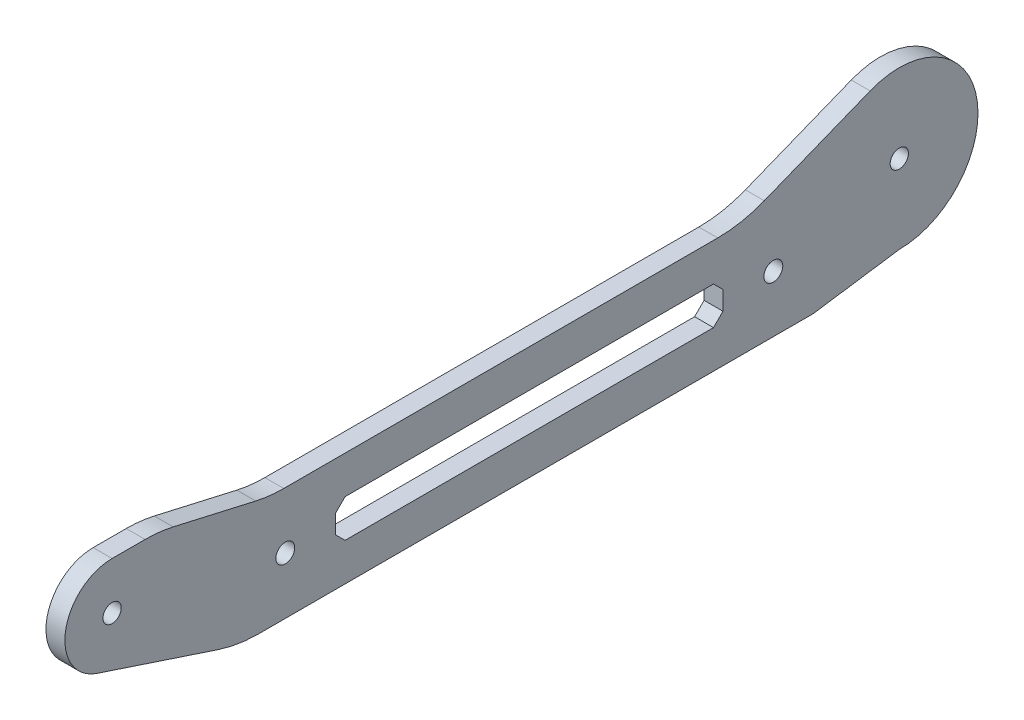
ISO-10303-21;
HEADER;
FILE_DESCRIPTION(('STEP AP214'),'2;1');
FILE_NAME('part.step','',(''),(''),'','','');
FILE_SCHEMA(('AUTOMOTIVE_DESIGN { 1 0 10303 214 1 1 1 1 }'));
ENDSEC;
DATA;
#1=APPLICATION_CONTEXT('core data for automotive mechanical design processes');
#2=APPLICATION_PROTOCOL_DEFINITION('international standard','automotive_design',2000,#1);
#3=PRODUCT_CONTEXT('',#1,'mechanical');
#4=PRODUCT('Part','Part','',(#3));
#5=PRODUCT_RELATED_PRODUCT_CATEGORY('part','',(#4));
#6=PRODUCT_DEFINITION_FORMATION('','',#4);
#7=PRODUCT_DEFINITION_CONTEXT('part definition',#1,'design');
#8=PRODUCT_DEFINITION('design','',#6,#7);
#9=PRODUCT_DEFINITION_SHAPE('','',#8);
#10=(LENGTH_UNIT() NAMED_UNIT(*) SI_UNIT(.MILLI.,.METRE.));
#11=(NAMED_UNIT(*) PLANE_ANGLE_UNIT() SI_UNIT($,.RADIAN.));
#12=(NAMED_UNIT(*) SI_UNIT($,.STERADIAN.) SOLID_ANGLE_UNIT());
#13=UNCERTAINTY_MEASURE_WITH_UNIT(LENGTH_MEASURE(1.E-05),#10,'distance_accuracy_value','');
#14=(GEOMETRIC_REPRESENTATION_CONTEXT(3) GLOBAL_UNCERTAINTY_ASSIGNED_CONTEXT((#13)) GLOBAL_UNIT_ASSIGNED_CONTEXT((#10,
#11,#12)) REPRESENTATION_CONTEXT('',''));
#15=CARTESIAN_POINT('',(0.,0.,0.));
#16=DIRECTION('',(0.,0.,1.));
#17=DIRECTION('',(1.,0.,0.));
#18=AXIS2_PLACEMENT_3D('',#15,#16,#17);
#19=CARTESIAN_POINT('',(1.5,10.5,10.5));
#20=DIRECTION('',(0.,0.707106781186548,0.707106781186547));
#21=DIRECTION('',(0.,-0.707106781186547,0.707106781186548));
#22=AXIS2_PLACEMENT_3D('',#19,#20,#21);
#23=PLANE('',#22);
#24=DIRECTION('',(0.,0.707106781186547,-0.707106781186548));
#25=VECTOR('',#24,1.);
#26=CARTESIAN_POINT('',(-1.5,10.5,10.5));
#27=LINE('',#26,#25);
#28=CARTESIAN_POINT('',(-1.5,-8.50000000000001,29.5));
#29=VERTEX_POINT('',#28);
#30=CARTESIAN_POINT('',(-1.5,-7.00000000000001,28.));
#31=VERTEX_POINT('',#30);
#32=EDGE_CURVE('E335',#29,#31,#27,.T.);
#33=ORIENTED_EDGE('',*,*,#32,.F.);
#34=DIRECTION('',(-1.,0.,0.));
#35=VECTOR('',#34,1.);
#36=CARTESIAN_POINT('',(1.5,-8.50000000000001,29.5));
#37=LINE('',#36,#35);
#38=CARTESIAN_POINT('',(1.5,-8.50000000000001,29.5));
#39=VERTEX_POINT('',#38);
#40=EDGE_CURVE('E218',#39,#29,#37,.T.);
#41=ORIENTED_EDGE('',*,*,#40,.F.);
#42=DIRECTION('',(0.,0.707106781186547,-0.707106781186548));
#43=VECTOR('',#42,1.);
#44=CARTESIAN_POINT('',(1.5,10.5,10.5));
#45=LINE('',#44,#43);
#46=CARTESIAN_POINT('',(1.5,-7.00000000000001,28.));
#47=VERTEX_POINT('',#46);
#48=EDGE_CURVE('E283',#39,#47,#45,.T.);
#49=ORIENTED_EDGE('',*,*,#48,.T.);
#50=DIRECTION('',(-1.,0.,0.));
#51=VECTOR('',#50,1.);
#52=CARTESIAN_POINT('',(1.5,-7.00000000000001,28.));
#53=LINE('',#52,#51);
#54=EDGE_CURVE('E205',#47,#31,#53,.T.);
#55=ORIENTED_EDGE('',*,*,#54,.T.);
#56=EDGE_LOOP('',(#33,#41,#49,#55));
#57=FACE_BOUND('',#56,.T.);
#58=ADVANCED_FACE('F35',(#57),#23,.T.);
#59=CARTESIAN_POINT('',(1.5,-8.50000000000001,0.));
#60=DIRECTION('',(0.,1.,0.));
#61=DIRECTION('',(0.,0.,1.));
#62=AXIS2_PLACEMENT_3D('',#59,#60,#61);
#63=PLANE('',#62);
#64=DIRECTION('',(0.,0.,-1.));
#65=VECTOR('',#64,1.);
#66=CARTESIAN_POINT('',(-1.5,-8.50000000000001,0.));
#67=LINE('',#66,#65);
#68=CARTESIAN_POINT('',(-1.5,-8.50000000000001,88.));
#69=VERTEX_POINT('',#68);
#70=EDGE_CURVE('E338',#69,#29,#67,.T.);
#71=ORIENTED_EDGE('',*,*,#70,.F.);
#72=DIRECTION('',(-1.,0.,0.));
#73=VECTOR('',#72,1.);
#74=CARTESIAN_POINT('',(1.5,-8.50000000000001,88.));
#75=LINE('',#74,#73);
#76=CARTESIAN_POINT('',(1.5,-8.50000000000001,88.));
#77=VERTEX_POINT('',#76);
#78=EDGE_CURVE('E374',#77,#69,#75,.T.);
#79=ORIENTED_EDGE('',*,*,#78,.F.);
#80=DIRECTION('',(0.,0.,-1.));
#81=VECTOR('',#80,1.);
#82=CARTESIAN_POINT('',(1.5,-8.50000000000001,0.));
#83=LINE('',#82,#81);
#84=EDGE_CURVE('E286',#77,#39,#83,.T.);
#85=ORIENTED_EDGE('',*,*,#84,.T.);
#86=ORIENTED_EDGE('',*,*,#40,.T.);
#87=EDGE_LOOP('',(#71,#79,#85,#86));
#88=FACE_BOUND('',#87,.T.);
#89=ADVANCED_FACE('F427',(#88),#63,.T.);
#90=CARTESIAN_POINT('',(1.5,-48.25,48.25));
#91=DIRECTION('',(0.,0.707106781186548,-0.707106781186547));
#92=DIRECTION('',(0.,0.707106781186547,0.707106781186548));
#93=AXIS2_PLACEMENT_3D('',#90,#91,#92);
#94=PLANE('',#93);
#95=DIRECTION('',(0.,-0.707106781186547,-0.707106781186548));
#96=VECTOR('',#95,1.);
#97=CARTESIAN_POINT('',(-1.5,-48.25,48.25));
#98=LINE('',#97,#96);
#99=CARTESIAN_POINT('',(-1.5,-7.00000000000001,89.5));
#100=VERTEX_POINT('',#99);
#101=EDGE_CURVE('E341',#100,#69,#98,.T.);
#102=ORIENTED_EDGE('',*,*,#101,.F.);
#103=DIRECTION('',(-1.,0.,0.));
#104=VECTOR('',#103,1.);
#105=CARTESIAN_POINT('',(1.5,-7.00000000000001,89.5));
#106=LINE('',#105,#104);
#107=CARTESIAN_POINT('',(1.5,-7.00000000000001,89.5));
#108=VERTEX_POINT('',#107);
#109=EDGE_CURVE('E372',#108,#100,#106,.T.);
#110=ORIENTED_EDGE('',*,*,#109,.F.);
#111=DIRECTION('',(0.,-0.707106781186547,-0.707106781186548));
#112=VECTOR('',#111,1.);
#113=CARTESIAN_POINT('',(1.5,-48.25,48.25));
#114=LINE('',#113,#112);
#115=EDGE_CURVE('E289',#108,#77,#114,.T.);
#116=ORIENTED_EDGE('',*,*,#115,.T.);
#117=ORIENTED_EDGE('',*,*,#78,.T.);
#118=EDGE_LOOP('',(#102,#110,#116,#117));
#119=FACE_BOUND('',#118,.T.);
#120=ADVANCED_FACE('F433',(#119),#94,.T.);
#121=CARTESIAN_POINT('',(1.5,0.,89.5));
#122=DIRECTION('',(0.,0.,-1.));
#123=DIRECTION('',(-1.,0.,0.));
#124=AXIS2_PLACEMENT_3D('',#121,#122,#123);
#125=PLANE('',#124);
#126=DIRECTION('',(0.,-1.,0.));
#127=VECTOR('',#126,1.);
#128=CARTESIAN_POINT('',(-1.5,0.,89.5));
#129=LINE('',#128,#127);
#130=CARTESIAN_POINT('',(-1.5,-4.00000000000002,89.5));
#131=VERTEX_POINT('',#130);
#132=EDGE_CURVE('E344',#131,#100,#129,.T.);
#133=ORIENTED_EDGE('',*,*,#132,.F.);
#134=DIRECTION('',(-1.,0.,0.));
#135=VECTOR('',#134,1.);
#136=CARTESIAN_POINT('',(1.5,-4.00000000000002,89.5));
#137=LINE('',#136,#135);
#138=CARTESIAN_POINT('',(1.5,-4.00000000000002,89.5));
#139=VERTEX_POINT('',#138);
#140=EDGE_CURVE('E370',#139,#131,#137,.T.);
#141=ORIENTED_EDGE('',*,*,#140,.F.);
#142=DIRECTION('',(0.,-1.,0.));
#143=VECTOR('',#142,1.);
#144=CARTESIAN_POINT('',(1.5,0.,89.5));
#145=LINE('',#144,#143);
#146=EDGE_CURVE('E292',#139,#108,#145,.T.);
#147=ORIENTED_EDGE('',*,*,#146,.T.);
#148=ORIENTED_EDGE('',*,*,#109,.T.);
#149=EDGE_LOOP('',(#133,#141,#147,#148));
#150=FACE_BOUND('',#149,.T.);
#151=ADVANCED_FACE('F478',(#150),#125,.T.);
#152=CARTESIAN_POINT('',(1.5,42.75,42.75));
#153=DIRECTION('',(0.,0.707106781186548,0.707106781186547));
#154=DIRECTION('',(0.,-0.707106781186547,0.707106781186548));
#155=AXIS2_PLACEMENT_3D('',#152,#153,#154);
#156=PLANE('',#155);
#157=DIRECTION('',(0.,0.707106781186547,-0.707106781186548));
#158=VECTOR('',#157,1.);
#159=CARTESIAN_POINT('',(-1.5,42.75,42.75));
#160=LINE('',#159,#158);
#161=CARTESIAN_POINT('',(-1.5,-2.50000000000001,88.));
#162=VERTEX_POINT('',#161);
#163=EDGE_CURVE('E347',#131,#162,#160,.T.);
#164=ORIENTED_EDGE('',*,*,#163,.T.);
#165=DIRECTION('',(-1.,0.,0.));
#166=VECTOR('',#165,1.);
#167=CARTESIAN_POINT('',(1.5,-2.50000000000001,88.));
#168=LINE('',#167,#166);
#169=CARTESIAN_POINT('',(1.5,-2.50000000000001,88.));
#170=VERTEX_POINT('',#169);
#171=EDGE_CURVE('E367',#170,#162,#168,.T.);
#172=ORIENTED_EDGE('',*,*,#171,.F.);
#173=DIRECTION('',(0.,0.707106781186547,-0.707106781186548));
#174=VECTOR('',#173,1.);
#175=CARTESIAN_POINT('',(1.5,42.75,42.75));
#176=LINE('',#175,#174);
#177=EDGE_CURVE('E295',#139,#170,#176,.T.);
#178=ORIENTED_EDGE('',*,*,#177,.F.);
#179=ORIENTED_EDGE('',*,*,#140,.T.);
#180=EDGE_LOOP('',(#164,#172,#178,#179));
#181=FACE_BOUND('',#180,.T.);
#182=ADVANCED_FACE('F474',(#181),#156,.F.);
#183=CARTESIAN_POINT('',(1.5,-2.50000000000001,0.));
#184=DIRECTION('',(0.,1.,0.));
#185=DIRECTION('',(0.,0.,1.));
#186=AXIS2_PLACEMENT_3D('',#183,#184,#185);
#187=PLANE('',#186);
#188=DIRECTION('',(0.,0.,-1.));
#189=VECTOR('',#188,1.);
#190=CARTESIAN_POINT('',(-1.5,-2.50000000000001,0.));
#191=LINE('',#190,#189);
#192=CARTESIAN_POINT('',(-1.5,-2.50000000000001,29.5));
#193=VERTEX_POINT('',#192);
#194=EDGE_CURVE('E350',#162,#193,#191,.T.);
#195=ORIENTED_EDGE('',*,*,#194,.T.);
#196=DIRECTION('',(-1.,0.,0.));
#197=VECTOR('',#196,1.);
#198=CARTESIAN_POINT('',(1.5,-2.50000000000001,29.5));
#199=LINE('',#198,#197);
#200=CARTESIAN_POINT('',(1.5,-2.50000000000001,29.5));
#201=VERTEX_POINT('',#200);
#202=EDGE_CURVE('E364',#201,#193,#199,.T.);
#203=ORIENTED_EDGE('',*,*,#202,.F.);
#204=DIRECTION('',(0.,0.,-1.));
#205=VECTOR('',#204,1.);
#206=CARTESIAN_POINT('',(1.5,-2.50000000000001,0.));
#207=LINE('',#206,#205);
#208=EDGE_CURVE('E298',#170,#201,#207,.T.);
#209=ORIENTED_EDGE('',*,*,#208,.F.);
#210=ORIENTED_EDGE('',*,*,#171,.T.);
#211=EDGE_LOOP('',(#195,#203,#209,#210));
#212=FACE_BOUND('',#211,.T.);
#213=ADVANCED_FACE('F470',(#212),#187,.F.);
#214=CARTESIAN_POINT('',(1.5,-16.,16.));
#215=DIRECTION('',(0.,0.707106781186548,-0.707106781186547));
#216=DIRECTION('',(0.,0.707106781186547,0.707106781186548));
#217=AXIS2_PLACEMENT_3D('',#214,#215,#216);
#218=PLANE('',#217);
#219=DIRECTION('',(0.,-0.707106781186547,-0.707106781186548));
#220=VECTOR('',#219,1.);
#221=CARTESIAN_POINT('',(-1.5,-16.,16.));
#222=LINE('',#221,#220);
#223=CARTESIAN_POINT('',(-1.5,-4.00000000000001,28.));
#224=VERTEX_POINT('',#223);
#225=EDGE_CURVE('E353',#193,#224,#222,.T.);
#226=ORIENTED_EDGE('',*,*,#225,.T.);
#227=DIRECTION('',(-1.,0.,0.));
#228=VECTOR('',#227,1.);
#229=CARTESIAN_POINT('',(1.5,-4.00000000000001,28.));
#230=LINE('',#229,#228);
#231=CARTESIAN_POINT('',(1.5,-4.00000000000001,28.));
#232=VERTEX_POINT('',#231);
#233=EDGE_CURVE('E208',#232,#224,#230,.T.);
#234=ORIENTED_EDGE('',*,*,#233,.F.);
#235=DIRECTION('',(0.,-0.707106781186547,-0.707106781186548));
#236=VECTOR('',#235,1.);
#237=CARTESIAN_POINT('',(1.5,-16.,16.));
#238=LINE('',#237,#236);
#239=EDGE_CURVE('E301',#201,#232,#238,.T.);
#240=ORIENTED_EDGE('',*,*,#239,.F.);
#241=ORIENTED_EDGE('',*,*,#202,.T.);
#242=EDGE_LOOP('',(#226,#234,#240,#241));
#243=FACE_BOUND('',#242,.T.);
#244=ADVANCED_FACE('F467',(#243),#218,.F.);
#245=CARTESIAN_POINT('',(1.5,0.,0.));
#246=DIRECTION('',(-1.,0.,0.));
#247=DIRECTION('',(0.,0.,1.));
#248=AXIS2_PLACEMENT_3D('',#245,#246,#247);
#249=CYLINDRICAL_SURFACE('',#248,12.5);
#250=CARTESIAN_POINT('',(-1.5,0.,0.));
#251=DIRECTION('',(1.,0.,0.));
#252=DIRECTION('',(0.,0.,-1.));
#253=AXIS2_PLACEMENT_3D('',#250,#251,#252);
#254=CIRCLE('',#253,12.5);
#255=CARTESIAN_POINT('',(-1.5,-12.5,0.));
#256=VERTEX_POINT('',#255);
#257=CARTESIAN_POINT('',(-1.5,11.6132366611717,4.62414686743596));
#258=VERTEX_POINT('',#257);
#259=EDGE_CURVE('E204',#256,#258,#254,.T.);
#260=ORIENTED_EDGE('',*,*,#259,.T.);
#261=DIRECTION('',(-1.,0.,0.));
#262=VECTOR('',#261,1.);
#263=CARTESIAN_POINT('',(1.5,11.6132366611717,4.62414686743596));
#264=LINE('',#263,#262);
#265=CARTESIAN_POINT('',(1.5,11.6132366611717,4.62414686743596));
#266=VERTEX_POINT('',#265);
#267=EDGE_CURVE('E183',#266,#258,#264,.T.);
#268=ORIENTED_EDGE('',*,*,#267,.F.);
#269=CARTESIAN_POINT('',(1.5,0.,0.));
#270=DIRECTION('',(1.,0.,0.));
#271=DIRECTION('',(0.,0.,-1.));
#272=AXIS2_PLACEMENT_3D('',#269,#270,#271);
#273=CIRCLE('',#272,12.5);
#274=CARTESIAN_POINT('',(1.5,-12.5,0.));
#275=VERTEX_POINT('',#274);
#276=EDGE_CURVE('E189',#275,#266,#273,.T.);
#277=ORIENTED_EDGE('',*,*,#276,.F.);
#278=DIRECTION('',(-1.,0.,0.));
#279=VECTOR('',#278,1.);
#280=CARTESIAN_POINT('',(1.5,-12.5,0.));
#281=LINE('',#280,#279);
#282=EDGE_CURVE('E309',#275,#256,#281,.T.);
#283=ORIENTED_EDGE('',*,*,#282,.T.);
#284=EDGE_LOOP('',(#260,#268,#277,#283));
#285=FACE_BOUND('',#284,.T.);
#286=ADVANCED_FACE('F202',(#285),#249,.T.);
#287=CARTESIAN_POINT('',(1.5,11.6132366611717,4.62414686743597));
#288=DIRECTION('',(0.,0.929058932893735,0.369931749394877));
#289=DIRECTION('',(0.,-0.369931749394877,0.929058932893735));
#290=AXIS2_PLACEMENT_3D('',#287,#288,#289);
#291=PLANE('',#290);
#292=DIRECTION('',(0.,0.369931749394877,-0.929058932893735));
#293=VECTOR('',#292,1.);
#294=CARTESIAN_POINT('',(-1.5,11.6132366611717,4.62414686743597));
#295=LINE('',#294,#293);
#296=CARTESIAN_POINT('',(-1.5,4.9188213421253,21.4367247627758));
#297=VERTEX_POINT('',#296);
#298=EDGE_CURVE('E248',#297,#258,#295,.T.);
#299=ORIENTED_EDGE('',*,*,#298,.F.);
#300=DIRECTION('',(-1.,0.,0.));
#301=VECTOR('',#300,1.);
#302=CARTESIAN_POINT('',(1.5,4.9188213421253,21.4367247627758));
#303=LINE('',#302,#301);
#304=CARTESIAN_POINT('',(1.5,4.9188213421253,21.4367247627758));
#305=VERTEX_POINT('',#304);
#306=EDGE_CURVE('E186',#297,#305,#303,.F.);
#307=ORIENTED_EDGE('',*,*,#306,.T.);
#308=DIRECTION('',(0.,0.369931749394877,-0.929058932893735));
#309=VECTOR('',#308,1.);
#310=CARTESIAN_POINT('',(1.5,11.6132366611717,4.62414686743597));
#311=LINE('',#310,#309);
#312=EDGE_CURVE('E178',#305,#266,#311,.T.);
#313=ORIENTED_EDGE('',*,*,#312,.T.);
#314=ORIENTED_EDGE('',*,*,#267,.T.);
#315=EDGE_LOOP('',(#299,#307,#313,#314));
#316=FACE_BOUND('',#315,.T.);
#317=ADVANCED_FACE('F181',(#316),#291,.T.);
#318=CARTESIAN_POINT('',(1.5,3.5,0.));
#319=DIRECTION('',(0.,1.,0.));
#320=DIRECTION('',(0.,0.,1.));
#321=AXIS2_PLACEMENT_3D('',#318,#319,#320);
#322=PLANE('',#321);
#323=DIRECTION('',(0.,0.,-1.));
#324=VECTOR('',#323,1.);
#325=CARTESIAN_POINT('',(-1.5,3.5,0.));
#326=LINE('',#325,#324);
#327=CARTESIAN_POINT('',(-1.5,3.5,97.7433846449188));
#328=VERTEX_POINT('',#327);
#329=CARTESIAN_POINT('',(-1.5,3.5,28.8353597506734));
#330=VERTEX_POINT('',#329);
#331=EDGE_CURVE('E250',#328,#330,#326,.T.);
#332=ORIENTED_EDGE('',*,*,#331,.F.);
#333=DIRECTION('',(-1.,0.,0.));
#334=VECTOR('',#333,1.);
#335=CARTESIAN_POINT('',(1.5,3.5,97.7433846449188));
#336=LINE('',#335,#334);
#337=CARTESIAN_POINT('',(1.5,3.5,97.7433846449188));
#338=VERTEX_POINT('',#337);
#339=EDGE_CURVE('E233',#328,#338,#336,.F.);
#340=ORIENTED_EDGE('',*,*,#339,.T.);
#341=DIRECTION('',(0.,0.,-1.));
#342=VECTOR('',#341,1.);
#343=CARTESIAN_POINT('',(1.5,3.5,0.));
#344=LINE('',#343,#342);
#345=CARTESIAN_POINT('',(1.5,3.5,28.8353597506734));
#346=VERTEX_POINT('',#345);
#347=EDGE_CURVE('E188',#338,#346,#344,.T.);
#348=ORIENTED_EDGE('',*,*,#347,.T.);
#349=DIRECTION('',(-1.,0.,0.));
#350=VECTOR('',#349,1.);
#351=CARTESIAN_POINT('',(-1.5,3.5,28.8353597506734));
#352=LINE('',#351,#350);
#353=EDGE_CURVE('E230',#346,#330,#352,.T.);
#354=ORIENTED_EDGE('',*,*,#353,.T.);
#355=EDGE_LOOP('',(#332,#340,#348,#354));
#356=FACE_BOUND('',#355,.T.);
#357=ADVANCED_FACE('F259',(#356),#322,.T.);
#358=CARTESIAN_POINT('',(1.5,-18.3960434445307,4.20480993017844));
#359=DIRECTION('',(0.,0.974858506571867,-0.222824801502141));
#360=DIRECTION('',(0.,0.222824801502141,0.974858506571867));
#361=AXIS2_PLACEMENT_3D('',#358,#359,#360);
#362=PLANE('',#361);
#363=DIRECTION('',(0.,-0.222824801502141,-0.974858506571867));
#364=VECTOR('',#363,1.);
#365=CARTESIAN_POINT('',(-1.5,-18.3960434445307,4.20480993017844));
#366=LINE('',#365,#364);
#367=CARTESIAN_POINT('',(-1.5,6.99717013143736,115.300119325038));
#368=VERTEX_POINT('',#367);
#369=CARTESIAN_POINT('',(-1.5,4.00282986856266,102.199880674962));
#370=VERTEX_POINT('',#369);
#371=EDGE_CURVE('E315',#368,#370,#366,.T.);
#372=ORIENTED_EDGE('',*,*,#371,.F.);
#373=DIRECTION('',(-1.,0.,0.));
#374=VECTOR('',#373,1.);
#375=CARTESIAN_POINT('',(1.5,6.99717013143735,115.300119325038));
#376=LINE('',#375,#374);
#377=CARTESIAN_POINT('',(1.5,6.99717013143736,115.300119325038));
#378=VERTEX_POINT('',#377);
#379=EDGE_CURVE('E225',#368,#378,#376,.F.);
#380=ORIENTED_EDGE('',*,*,#379,.T.);
#381=DIRECTION('',(0.,-0.222824801502141,-0.974858506571867));
#382=VECTOR('',#381,1.);
#383=CARTESIAN_POINT('',(1.5,-18.3960434445307,4.20480993017844));
#384=LINE('',#383,#382);
#385=CARTESIAN_POINT('',(1.5,4.00282986856266,102.199880674962));
#386=VERTEX_POINT('',#385);
#387=EDGE_CURVE('E261',#378,#386,#384,.T.);
#388=ORIENTED_EDGE('',*,*,#387,.T.);
#389=DIRECTION('',(-1.,0.,0.));
#390=VECTOR('',#389,1.);
#391=CARTESIAN_POINT('',(-1.5,4.00282986856265,102.199880674962));
#392=LINE('',#391,#390);
#393=EDGE_CURVE('E222',#386,#370,#392,.T.);
#394=ORIENTED_EDGE('',*,*,#393,.T.);
#395=EDGE_LOOP('',(#372,#380,#388,#394));
#396=FACE_BOUND('',#395,.T.);
#397=ADVANCED_FACE('F398',(#396),#362,.T.);
#398=CARTESIAN_POINT('',(1.5,7.4999999999998,0.));
#399=DIRECTION('',(0.,1.,0.));
#400=DIRECTION('',(0.,0.,1.));
#401=AXIS2_PLACEMENT_3D('',#398,#399,#400);
#402=PLANE('',#401);
#403=DIRECTION('',(0.,0.,-1.));
#404=VECTOR('',#403,1.);
#405=CARTESIAN_POINT('',(1.5,7.4999999999998,0.));
#406=LINE('',#405,#404);
#407=CARTESIAN_POINT('',(1.5,7.50000000000001,125.));
#408=VERTEX_POINT('',#407);
#409=CARTESIAN_POINT('',(1.5,7.5,119.756615355081));
#410=VERTEX_POINT('',#409);
#411=EDGE_CURVE('E264',#408,#410,#406,.T.);
#412=ORIENTED_EDGE('',*,*,#411,.T.);
#413=DIRECTION('',(-1.,0.,0.));
#414=VECTOR('',#413,1.);
#415=CARTESIAN_POINT('',(1.5,7.5,119.756615355081));
#416=LINE('',#415,#414);
#417=CARTESIAN_POINT('',(-1.5,7.5,119.756615355081));
#418=VERTEX_POINT('',#417);
#419=EDGE_CURVE('E214',#410,#418,#416,.T.);
#420=ORIENTED_EDGE('',*,*,#419,.T.);
#421=DIRECTION('',(0.,0.,-1.));
#422=VECTOR('',#421,1.);
#423=CARTESIAN_POINT('',(-1.5,7.4999999999998,0.));
#424=LINE('',#423,#422);
#425=CARTESIAN_POINT('',(-1.5,7.50000000000001,125.));
#426=VERTEX_POINT('',#425);
#427=EDGE_CURVE('E318',#426,#418,#424,.T.);
#428=ORIENTED_EDGE('',*,*,#427,.F.);
#429=DIRECTION('',(-1.,0.,0.));
#430=VECTOR('',#429,1.);
#431=CARTESIAN_POINT('',(1.5,7.50000000000001,125.));
#432=LINE('',#431,#430);
#433=EDGE_CURVE('E206',#408,#426,#432,.T.);
#434=ORIENTED_EDGE('',*,*,#433,.F.);
#435=EDGE_LOOP('',(#412,#420,#428,#434));
#436=FACE_BOUND('',#435,.T.);
#437=ADVANCED_FACE('F389',(#436),#402,.T.);
#438=CARTESIAN_POINT('',(1.5,0.,125.));
#439=DIRECTION('',(-1.,0.,0.));
#440=DIRECTION('',(0.,0.,1.));
#441=AXIS2_PLACEMENT_3D('',#438,#439,#440);
#442=CYLINDRICAL_SURFACE('',#441,7.50000000000001);
#443=CARTESIAN_POINT('',(-1.5,0.,125.));
#444=DIRECTION('',(1.,0.,0.));
#445=DIRECTION('',(0.,0.,-1.));
#446=AXIS2_PLACEMENT_3D('',#443,#444,#445);
#447=CIRCLE('',#446,7.50000000000001);
#448=CARTESIAN_POINT('',(-1.5,-7.12200850271521,127.350956164468));
#449=VERTEX_POINT('',#448);
#450=EDGE_CURVE('E320',#426,#449,#447,.T.);
#451=ORIENTED_EDGE('',*,*,#450,.T.);
#452=DIRECTION('',(-1.,0.,0.));
#453=VECTOR('',#452,1.);
#454=CARTESIAN_POINT('',(1.5,-7.12200850271521,127.350956164468));
#455=LINE('',#454,#453);
#456=CARTESIAN_POINT('',(1.5,-7.12200850271521,127.350956164468));
#457=VERTEX_POINT('',#456);
#458=EDGE_CURVE('E210',#457,#449,#455,.T.);
#459=ORIENTED_EDGE('',*,*,#458,.F.);
#460=CARTESIAN_POINT('',(1.5,0.,125.));
#461=DIRECTION('',(1.,0.,0.));
#462=DIRECTION('',(0.,0.,-1.));
#463=AXIS2_PLACEMENT_3D('',#460,#461,#462);
#464=CIRCLE('',#463,7.50000000000001);
#465=EDGE_CURVE('E269',#408,#457,#464,.T.);
#466=ORIENTED_EDGE('',*,*,#465,.F.);
#467=ORIENTED_EDGE('',*,*,#433,.T.);
#468=EDGE_LOOP('',(#451,#459,#466,#467));
#469=FACE_BOUND('',#468,.T.);
#470=ADVANCED_FACE('F386',(#469),#442,.T.);
#471=CARTESIAN_POINT('',(1.5,-44.3298524868384,14.6331670250296));
#472=DIRECTION('',(0.,-0.949601133695359,0.313460821929135));
#473=DIRECTION('',(0.,-0.313460821929135,-0.949601133695359));
#474=AXIS2_PLACEMENT_3D('',#471,#472,#473);
#475=PLANE('',#474);
#476=DIRECTION('',(0.,0.313460821929135,0.949601133695359));
#477=VECTOR('',#476,1.);
#478=CARTESIAN_POINT('',(-1.5,-44.3298524868384,14.6331670250296));
#479=LINE('',#478,#477);
#480=CARTESIAN_POINT('',(-1.5,-13.4920226739072,108.05357590051));
#481=VERTEX_POINT('',#480);
#482=EDGE_CURVE('E323',#481,#449,#479,.T.);
#483=ORIENTED_EDGE('',*,*,#482,.F.);
#484=DIRECTION('',(-1.,0.,0.));
#485=VECTOR('',#484,1.);
#486=CARTESIAN_POINT('',(1.5,-13.4920226739072,108.05357590051));
#487=LINE('',#486,#485);
#488=CARTESIAN_POINT('',(1.5,-13.4920226739072,108.05357590051));
#489=VERTEX_POINT('',#488);
#490=EDGE_CURVE('E58',#481,#489,#487,.F.);
#491=ORIENTED_EDGE('',*,*,#490,.T.);
#492=DIRECTION('',(0.,0.313460821929135,0.949601133695359));
#493=VECTOR('',#492,1.);
#494=CARTESIAN_POINT('',(1.5,-44.3298524868384,14.6331670250296));
#495=LINE('',#494,#493);
#496=EDGE_CURVE('E272',#489,#457,#495,.T.);
#497=ORIENTED_EDGE('',*,*,#496,.T.);
#498=ORIENTED_EDGE('',*,*,#458,.T.);
#499=EDGE_LOOP('',(#483,#491,#497,#498));
#500=FACE_BOUND('',#499,.T.);
#501=ADVANCED_FACE('F382',(#500),#475,.T.);
#502=CARTESIAN_POINT('',(1.5,-14.5,0.));
#503=DIRECTION('',(0.,1.,0.));
#504=DIRECTION('',(0.,0.,1.));
#505=AXIS2_PLACEMENT_3D('',#502,#503,#504);
#506=PLANE('',#505);
#507=DIRECTION('',(0.,0.,-1.));
#508=VECTOR('',#507,1.);
#509=CARTESIAN_POINT('',(1.5,-14.5,0.));
#510=LINE('',#509,#508);
#511=CARTESIAN_POINT('',(1.5,-14.5,101.784359461928));
#512=VERTEX_POINT('',#511);
#513=CARTESIAN_POINT('',(1.5,-14.5,13.675));
#514=VERTEX_POINT('',#513);
#515=EDGE_CURVE('E274',#512,#514,#510,.T.);
#516=ORIENTED_EDGE('',*,*,#515,.F.);
#517=DIRECTION('',(-1.,0.,0.));
#518=VECTOR('',#517,1.);
#519=CARTESIAN_POINT('',(-1.5,-14.5,101.784359461928));
#520=LINE('',#519,#518);
#521=CARTESIAN_POINT('',(-1.5,-14.5,101.784359461928));
#522=VERTEX_POINT('',#521);
#523=EDGE_CURVE('E236',#512,#522,#520,.T.);
#524=ORIENTED_EDGE('',*,*,#523,.T.);
#525=DIRECTION('',(0.,0.,-1.));
#526=VECTOR('',#525,1.);
#527=CARTESIAN_POINT('',(-1.5,-14.5,0.));
#528=LINE('',#527,#526);
#529=CARTESIAN_POINT('',(-1.5,-14.5,13.675));
#530=VERTEX_POINT('',#529);
#531=EDGE_CURVE('E325',#522,#530,#528,.T.);
#532=ORIENTED_EDGE('',*,*,#531,.T.);
#533=DIRECTION('',(-1.,0.,0.));
#534=VECTOR('',#533,1.);
#535=CARTESIAN_POINT('',(1.5,-14.5,13.675));
#536=LINE('',#535,#534);
#537=EDGE_CURVE('E378',#514,#530,#536,.T.);
#538=ORIENTED_EDGE('',*,*,#537,.F.);
#539=EDGE_LOOP('',(#516,#524,#532,#538));
#540=FACE_BOUND('',#539,.T.);
#541=ADVANCED_FACE('F406',(#540),#506,.F.);
#542=CARTESIAN_POINT('',(1.5,0.,28.));
#543=DIRECTION('',(0.,0.,-1.));
#544=DIRECTION('',(-1.,0.,0.));
#545=AXIS2_PLACEMENT_3D('',#542,#543,#544);
#546=PLANE('',#545);
#547=DIRECTION('',(0.,-1.,0.));
#548=VECTOR('',#547,1.);
#549=CARTESIAN_POINT('',(-1.5,0.,28.));
#550=LINE('',#549,#548);
#551=EDGE_CURVE('E356',#224,#31,#550,.T.);
#552=ORIENTED_EDGE('',*,*,#551,.T.);
#553=ORIENTED_EDGE('',*,*,#54,.F.);
#554=DIRECTION('',(0.,-1.,0.));
#555=VECTOR('',#554,1.);
#556=CARTESIAN_POINT('',(1.5,0.,28.));
#557=LINE('',#556,#555);
#558=EDGE_CURVE('E304',#232,#47,#557,.T.);
#559=ORIENTED_EDGE('',*,*,#558,.F.);
#560=ORIENTED_EDGE('',*,*,#233,.T.);
#561=EDGE_LOOP('',(#552,#553,#559,#560));
#562=FACE_BOUND('',#561,.T.);
#563=ADVANCED_FACE('F440',(#562),#546,.F.);
#564=CARTESIAN_POINT('',(1.5,-5.5,97.5));
#565=DIRECTION('',(-1.,0.,0.));
#566=DIRECTION('',(0.,0.,1.));
#567=AXIS2_PLACEMENT_3D('',#564,#565,#566);
#568=CYLINDRICAL_SURFACE('',#567,1.5);
#569=CARTESIAN_POINT('',(1.5,-5.5,97.5));
#570=DIRECTION('',(1.,0.,0.));
#571=DIRECTION('',(0.,0.,-1.));
#572=AXIS2_PLACEMENT_3D('',#569,#570,#571);
#573=CIRCLE('',#572,1.5);
#574=CARTESIAN_POINT('',(1.5,-5.5,96.));
#575=VERTEX_POINT('',#574);
#576=EDGE_CURVE('E280',#575,#575,#573,.T.);
#577=ORIENTED_EDGE('',*,*,#576,.T.);
#578=EDGE_LOOP('',(#577));
#579=FACE_BOUND('',#578,.T.);
#580=CARTESIAN_POINT('',(-1.5,-5.5,97.5));
#581=DIRECTION('',(1.,0.,0.));
#582=DIRECTION('',(0.,0.,-1.));
#583=AXIS2_PLACEMENT_3D('',#580,#581,#582);
#584=CIRCLE('',#583,1.5);
#585=CARTESIAN_POINT('',(-1.5,-5.5,96.));
#586=VERTEX_POINT('',#585);
#587=EDGE_CURVE('E332',#586,#586,#584,.T.);
#588=ORIENTED_EDGE('',*,*,#587,.F.);
#589=EDGE_LOOP('',(#588));
#590=FACE_BOUND('',#589,.T.);
#591=ADVANCED_FACE('F422',(#579,#590),#568,.F.);
#592=CARTESIAN_POINT('',(1.5,-5.5,20.));
#593=DIRECTION('',(-1.,0.,0.));
#594=DIRECTION('',(0.,0.,1.));
#595=AXIS2_PLACEMENT_3D('',#592,#593,#594);
#596=CYLINDRICAL_SURFACE('',#595,1.5);
#597=CARTESIAN_POINT('',(1.5,-5.5,20.));
#598=DIRECTION('',(1.,0.,0.));
#599=DIRECTION('',(0.,0.,-1.));
#600=AXIS2_PLACEMENT_3D('',#597,#598,#599);
#601=CIRCLE('',#600,1.5);
#602=CARTESIAN_POINT('',(1.5,-5.5,18.5));
#603=VERTEX_POINT('',#602);
#604=EDGE_CURVE('E277',#603,#603,#601,.T.);
#605=ORIENTED_EDGE('',*,*,#604,.T.);
#606=EDGE_LOOP('',(#605));
#607=FACE_BOUND('',#606,.T.);
#608=CARTESIAN_POINT('',(-1.5,-5.5,20.));
#609=DIRECTION('',(1.,0.,0.));
#610=DIRECTION('',(0.,0.,-1.));
#611=AXIS2_PLACEMENT_3D('',#608,#609,#610);
#612=CIRCLE('',#611,1.5);
#613=CARTESIAN_POINT('',(-1.5,-5.5,18.5));
#614=VERTEX_POINT('',#613);
#615=EDGE_CURVE('E329',#614,#614,#612,.T.);
#616=ORIENTED_EDGE('',*,*,#615,.F.);
#617=EDGE_LOOP('',(#616));
#618=FACE_BOUND('',#617,.T.);
#619=ADVANCED_FACE('F413',(#607,#618),#596,.F.);
#620=CARTESIAN_POINT('',(1.5,-12.2382276045535,-1.78986875386523));
#621=DIRECTION('',(0.,0.989473702714874,0.144712790159397));
#622=DIRECTION('',(0.,-0.144712790159397,0.989473702714874));
#623=AXIS2_PLACEMENT_3D('',#620,#621,#622);
#624=PLANE('',#623);
#625=DIRECTION('',(0.,0.144712790159397,-0.989473702714874));
#626=VECTOR('',#625,1.);
#627=CARTESIAN_POINT('',(-1.5,-12.2382276045535,-1.78986875386523));
#628=LINE('',#627,#626);
#629=EDGE_CURVE('E327',#530,#256,#628,.T.);
#630=ORIENTED_EDGE('',*,*,#629,.T.);
#631=ORIENTED_EDGE('',*,*,#282,.F.);
#632=DIRECTION('',(0.,0.144712790159397,-0.989473702714874));
#633=VECTOR('',#632,1.);
#634=CARTESIAN_POINT('',(1.5,-12.2382276045535,-1.78986875386523));
#635=LINE('',#634,#633);
#636=EDGE_CURVE('E196',#514,#275,#635,.T.);
#637=ORIENTED_EDGE('',*,*,#636,.F.);
#638=ORIENTED_EDGE('',*,*,#537,.T.);
#639=EDGE_LOOP('',(#630,#631,#637,#638));
#640=FACE_BOUND('',#639,.T.);
#641=ADVANCED_FACE('F410',(#640),#624,.F.);
#642=CARTESIAN_POINT('',(1.5,0.,0.));
#643=DIRECTION('',(-1.,0.,0.));
#644=DIRECTION('',(0.,0.,1.));
#645=AXIS2_PLACEMENT_3D('',#642,#643,#644);
#646=CYLINDRICAL_SURFACE('',#645,1.45);
#647=CARTESIAN_POINT('',(1.5,0.,0.));
#648=DIRECTION('',(1.,0.,0.));
#649=DIRECTION('',(0.,0.,-1.));
#650=AXIS2_PLACEMENT_3D('',#647,#648,#649);
#651=CIRCLE('',#650,1.45);
#652=CARTESIAN_POINT('',(1.5,0.,-1.45));
#653=VERTEX_POINT('',#652);
#654=EDGE_CURVE('E200',#653,#653,#651,.T.);
#655=ORIENTED_EDGE('',*,*,#654,.T.);
#656=EDGE_LOOP('',(#655));
#657=FACE_BOUND('',#656,.T.);
#658=CARTESIAN_POINT('',(-1.5,0.,0.));
#659=DIRECTION('',(1.,0.,0.));
#660=DIRECTION('',(0.,0.,-1.));
#661=AXIS2_PLACEMENT_3D('',#658,#659,#660);
#662=CIRCLE('',#661,1.45);
#663=CARTESIAN_POINT('',(-1.5,0.,-1.45));
#664=VERTEX_POINT('',#663);
#665=EDGE_CURVE('E310',#664,#664,#662,.T.);
#666=ORIENTED_EDGE('',*,*,#665,.F.);
#667=EDGE_LOOP('',(#666));
#668=FACE_BOUND('',#667,.T.);
#669=ADVANCED_FACE('F412',(#657,#668),#646,.F.);
#670=CARTESIAN_POINT('',(1.5,0.,125.));
#671=DIRECTION('',(-1.,0.,0.));
#672=DIRECTION('',(0.,0.,1.));
#673=AXIS2_PLACEMENT_3D('',#670,#671,#672);
#674=CYLINDRICAL_SURFACE('',#673,1.45);
#675=CARTESIAN_POINT('',(1.5,0.,125.));
#676=DIRECTION('',(1.,0.,0.));
#677=DIRECTION('',(0.,0.,-1.));
#678=AXIS2_PLACEMENT_3D('',#675,#676,#677);
#679=CIRCLE('',#678,1.45);
#680=CARTESIAN_POINT('',(1.5,0.,123.55));
#681=VERTEX_POINT('',#680);
#682=EDGE_CURVE('E306',#681,#681,#679,.T.);
#683=ORIENTED_EDGE('',*,*,#682,.T.);
#684=EDGE_LOOP('',(#683));
#685=FACE_BOUND('',#684,.T.);
#686=CARTESIAN_POINT('',(-1.5,0.,125.));
#687=DIRECTION('',(1.,0.,0.));
#688=DIRECTION('',(0.,0.,-1.));
#689=AXIS2_PLACEMENT_3D('',#686,#687,#688);
#690=CIRCLE('',#689,1.45);
#691=CARTESIAN_POINT('',(-1.5,0.,123.55));
#692=VERTEX_POINT('',#691);
#693=EDGE_CURVE('E359',#692,#692,#690,.T.);
#694=ORIENTED_EDGE('',*,*,#693,.F.);
#695=EDGE_LOOP('',(#694));
#696=FACE_BOUND('',#695,.T.);
#697=ADVANCED_FACE('F419',(#685,#696),#674,.F.);
#698=CARTESIAN_POINT('',(1.5,0.,0.));
#699=DIRECTION('',(1.,0.,0.));
#700=DIRECTION('',(0.,0.,-1.));
#701=AXIS2_PLACEMENT_3D('',#698,#699,#700);
#702=PLANE('',#701);
#703=ORIENTED_EDGE('',*,*,#654,.F.);
#704=EDGE_LOOP('',(#703));
#705=FACE_BOUND('',#704,.T.);
#706=ORIENTED_EDGE('',*,*,#387,.F.);
#707=CARTESIAN_POINT('',(1.5,-12.5,119.756615355081));
#708=DIRECTION('',(1.,0.,0.));
#709=DIRECTION('',(0.,0.,-1.));
#710=AXIS2_PLACEMENT_3D('',#707,#708,#709);
#711=CIRCLE('',#710,20.);
#712=EDGE_CURVE('E228',#378,#410,#711,.T.);
#713=ORIENTED_EDGE('',*,*,#712,.T.);
#714=ORIENTED_EDGE('',*,*,#411,.F.);
#715=ORIENTED_EDGE('',*,*,#465,.T.);
#716=ORIENTED_EDGE('',*,*,#496,.F.);
#717=CARTESIAN_POINT('',(1.5,5.5,101.784359461928));
#718=DIRECTION('',(1.,0.,0.));
#719=DIRECTION('',(0.,0.,-1.));
#720=AXIS2_PLACEMENT_3D('',#717,#718,#719);
#721=CIRCLE('',#720,20.);
#722=EDGE_CURVE('E50',#489,#512,#721,.T.);
#723=ORIENTED_EDGE('',*,*,#722,.T.);
#724=ORIENTED_EDGE('',*,*,#515,.T.);
#725=ORIENTED_EDGE('',*,*,#636,.T.);
#726=ORIENTED_EDGE('',*,*,#276,.T.);
#727=ORIENTED_EDGE('',*,*,#312,.F.);
#728=CARTESIAN_POINT('',(1.5,23.5,28.8353597506734));
#729=DIRECTION('',(1.,0.,0.));
#730=DIRECTION('',(0.,0.,-1.));
#731=AXIS2_PLACEMENT_3D('',#728,#729,#730);
#732=CIRCLE('',#731,20.);
#733=EDGE_CURVE('E11',#305,#346,#732,.F.);
#734=ORIENTED_EDGE('',*,*,#733,.T.);
#735=ORIENTED_EDGE('',*,*,#347,.F.);
#736=CARTESIAN_POINT('',(1.5,23.5,97.7433846449188));
#737=DIRECTION('',(1.,0.,0.));
#738=DIRECTION('',(0.,0.,-1.));
#739=AXIS2_PLACEMENT_3D('',#736,#737,#738);
#740=CIRCLE('',#739,20.);
#741=EDGE_CURVE('E242',#338,#386,#740,.F.);
#742=ORIENTED_EDGE('',*,*,#741,.T.);
#743=EDGE_LOOP('',(#706,#713,#714,#715,#716,#723,#724,#725,#726,#727,#734,#735,#742));
#744=FACE_BOUND('',#743,.T.);
#745=ORIENTED_EDGE('',*,*,#604,.F.);
#746=EDGE_LOOP('',(#745));
#747=FACE_BOUND('',#746,.T.);
#748=ORIENTED_EDGE('',*,*,#576,.F.);
#749=EDGE_LOOP('',(#748));
#750=FACE_BOUND('',#749,.T.);
#751=ORIENTED_EDGE('',*,*,#48,.F.);
#752=ORIENTED_EDGE('',*,*,#84,.F.);
#753=ORIENTED_EDGE('',*,*,#115,.F.);
#754=ORIENTED_EDGE('',*,*,#146,.F.);
#755=ORIENTED_EDGE('',*,*,#177,.T.);
#756=ORIENTED_EDGE('',*,*,#208,.T.);
#757=ORIENTED_EDGE('',*,*,#239,.T.);
#758=ORIENTED_EDGE('',*,*,#558,.T.);
#759=EDGE_LOOP('',(#751,#752,#753,#754,#755,#756,#757,#758));
#760=FACE_BOUND('',#759,.T.);
#761=ORIENTED_EDGE('',*,*,#682,.F.);
#762=EDGE_LOOP('',(#761));
#763=FACE_BOUND('',#762,.T.);
#764=ADVANCED_FACE('F193',(#705,#744,#747,#750,#760,#763),#702,.T.);
#765=CARTESIAN_POINT('',(-1.5,0.,0.));
#766=DIRECTION('',(1.,0.,0.));
#767=DIRECTION('',(0.,0.,-1.));
#768=AXIS2_PLACEMENT_3D('',#765,#766,#767);
#769=PLANE('',#768);
#770=ORIENTED_EDGE('',*,*,#665,.T.);
#771=EDGE_LOOP('',(#770));
#772=FACE_BOUND('',#771,.T.);
#773=ORIENTED_EDGE('',*,*,#427,.T.);
#774=CARTESIAN_POINT('',(-1.5,-12.5,119.756615355081));
#775=DIRECTION('',(1.,0.,0.));
#776=DIRECTION('',(0.,0.,-1.));
#777=AXIS2_PLACEMENT_3D('',#774,#775,#776);
#778=CIRCLE('',#777,20.);
#779=EDGE_CURVE('E220',#418,#368,#778,.F.);
#780=ORIENTED_EDGE('',*,*,#779,.T.);
#781=ORIENTED_EDGE('',*,*,#371,.T.);
#782=CARTESIAN_POINT('',(-1.5,23.5,97.7433846449188));
#783=DIRECTION('',(1.,0.,0.));
#784=DIRECTION('',(0.,0.,-1.));
#785=AXIS2_PLACEMENT_3D('',#782,#783,#784);
#786=CIRCLE('',#785,20.);
#787=EDGE_CURVE('E240',#370,#328,#786,.T.);
#788=ORIENTED_EDGE('',*,*,#787,.T.);
#789=ORIENTED_EDGE('',*,*,#331,.T.);
#790=CARTESIAN_POINT('',(-1.5,23.5,28.8353597506734));
#791=DIRECTION('',(1.,0.,0.));
#792=DIRECTION('',(0.,0.,-1.));
#793=AXIS2_PLACEMENT_3D('',#790,#791,#792);
#794=CIRCLE('',#793,20.);
#795=EDGE_CURVE('E43',#330,#297,#794,.T.);
#796=ORIENTED_EDGE('',*,*,#795,.T.);
#797=ORIENTED_EDGE('',*,*,#298,.T.);
#798=ORIENTED_EDGE('',*,*,#259,.F.);
#799=ORIENTED_EDGE('',*,*,#629,.F.);
#800=ORIENTED_EDGE('',*,*,#531,.F.);
#801=CARTESIAN_POINT('',(-1.5,5.5,101.784359461928));
#802=DIRECTION('',(1.,0.,0.));
#803=DIRECTION('',(0.,0.,-1.));
#804=AXIS2_PLACEMENT_3D('',#801,#802,#803);
#805=CIRCLE('',#804,20.);
#806=EDGE_CURVE('E217',#522,#481,#805,.F.);
#807=ORIENTED_EDGE('',*,*,#806,.T.);
#808=ORIENTED_EDGE('',*,*,#482,.T.);
#809=ORIENTED_EDGE('',*,*,#450,.F.);
#810=EDGE_LOOP('',(#773,#780,#781,#788,#789,#796,#797,#798,#799,#800,#807,#808,#809));
#811=FACE_BOUND('',#810,.T.);
#812=ORIENTED_EDGE('',*,*,#615,.T.);
#813=EDGE_LOOP('',(#812));
#814=FACE_BOUND('',#813,.T.);
#815=ORIENTED_EDGE('',*,*,#587,.T.);
#816=EDGE_LOOP('',(#815));
#817=FACE_BOUND('',#816,.T.);
#818=ORIENTED_EDGE('',*,*,#32,.T.);
#819=ORIENTED_EDGE('',*,*,#551,.F.);
#820=ORIENTED_EDGE('',*,*,#225,.F.);
#821=ORIENTED_EDGE('',*,*,#194,.F.);
#822=ORIENTED_EDGE('',*,*,#163,.F.);
#823=ORIENTED_EDGE('',*,*,#132,.T.);
#824=ORIENTED_EDGE('',*,*,#101,.T.);
#825=ORIENTED_EDGE('',*,*,#70,.T.);
#826=EDGE_LOOP('',(#818,#819,#820,#821,#822,#823,#824,#825));
#827=FACE_BOUND('',#826,.T.);
#828=ORIENTED_EDGE('',*,*,#693,.T.);
#829=EDGE_LOOP('',(#828));
#830=FACE_BOUND('',#829,.T.);
#831=ADVANCED_FACE('F246',(#772,#811,#814,#817,#827,#830),#769,.F.);
#832=CARTESIAN_POINT('',(1.5,-12.5,119.756615355081));
#833=DIRECTION('',(-1.,0.,0.));
#834=DIRECTION('',(0.,0.,1.));
#835=AXIS2_PLACEMENT_3D('',#832,#833,#834);
#836=CYLINDRICAL_SURFACE('',#835,20.);
#837=ORIENTED_EDGE('',*,*,#712,.F.);
#838=ORIENTED_EDGE('',*,*,#379,.F.);
#839=ORIENTED_EDGE('',*,*,#779,.F.);
#840=ORIENTED_EDGE('',*,*,#419,.F.);
#841=EDGE_LOOP('',(#837,#838,#839,#840));
#842=FACE_BOUND('',#841,.T.);
#843=ADVANCED_FACE('F394',(#842),#836,.T.);
#844=CARTESIAN_POINT('',(1.5,23.5,97.7433846449188));
#845=DIRECTION('',(1.,0.,0.));
#846=DIRECTION('',(0.,0.,-1.));
#847=AXIS2_PLACEMENT_3D('',#844,#845,#846);
#848=CYLINDRICAL_SURFACE('',#847,20.);
#849=ORIENTED_EDGE('',*,*,#741,.F.);
#850=ORIENTED_EDGE('',*,*,#339,.F.);
#851=ORIENTED_EDGE('',*,*,#787,.F.);
#852=ORIENTED_EDGE('',*,*,#393,.F.);
#853=EDGE_LOOP('',(#849,#850,#851,#852));
#854=FACE_BOUND('',#853,.T.);
#855=ADVANCED_FACE('F401',(#854),#848,.F.);
#856=CARTESIAN_POINT('',(1.5,23.5,28.8353597506734));
#857=DIRECTION('',(1.,0.,0.));
#858=DIRECTION('',(0.,0.,-1.));
#859=AXIS2_PLACEMENT_3D('',#856,#857,#858);
#860=CYLINDRICAL_SURFACE('',#859,20.);
#861=ORIENTED_EDGE('',*,*,#733,.F.);
#862=ORIENTED_EDGE('',*,*,#306,.F.);
#863=ORIENTED_EDGE('',*,*,#795,.F.);
#864=ORIENTED_EDGE('',*,*,#353,.F.);
#865=EDGE_LOOP('',(#861,#862,#863,#864));
#866=FACE_BOUND('',#865,.T.);
#867=ADVANCED_FACE('F254',(#866),#860,.F.);
#868=CARTESIAN_POINT('',(1.5,5.5,101.784359461928));
#869=DIRECTION('',(1.,0.,0.));
#870=DIRECTION('',(0.,0.,-1.));
#871=AXIS2_PLACEMENT_3D('',#868,#869,#870);
#872=CYLINDRICAL_SURFACE('',#871,20.);
#873=ORIENTED_EDGE('',*,*,#722,.F.);
#874=ORIENTED_EDGE('',*,*,#490,.F.);
#875=ORIENTED_EDGE('',*,*,#806,.F.);
#876=ORIENTED_EDGE('',*,*,#523,.F.);
#877=EDGE_LOOP('',(#873,#874,#875,#876));
#878=FACE_BOUND('',#877,.T.);
#879=ADVANCED_FACE('F37',(#878),#872,.T.);
#880=CLOSED_SHELL('',(#58,#89,#120,#151,#182,#213,#244,#286,#317,#357,#397,#437,#470,#501,#541,
#563,#591,#619,#641,#669,#697,#764,#831,#843,#855,#867,#879));
#881=MANIFOLD_SOLID_BREP('B2',#880);
#882=ADVANCED_BREP_SHAPE_REPRESENTATION('',(#18,#881),#14);
#883=SHAPE_DEFINITION_REPRESENTATION(#9,#882);
ENDSEC;
END-ISO-10303-21;
